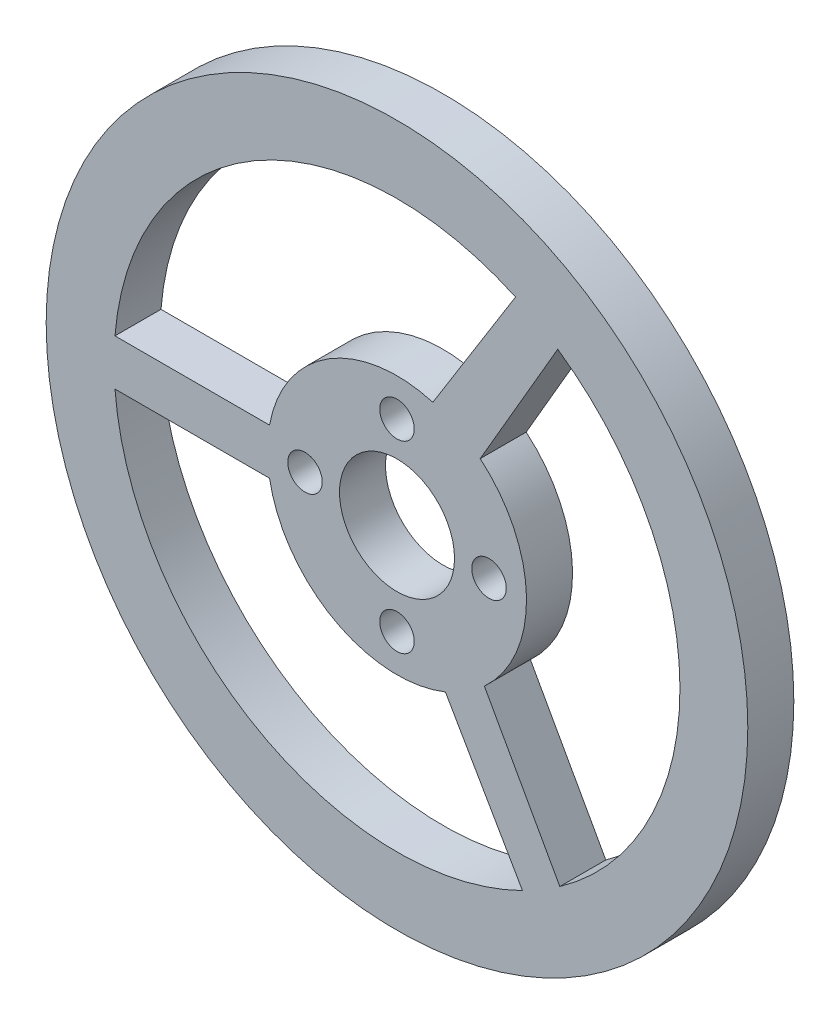
ISO-10303-21;
HEADER;
FILE_DESCRIPTION(('STEP AP214'),'2;1');
FILE_NAME('part.step','',(''),(''),'','','');
FILE_SCHEMA(('AUTOMOTIVE_DESIGN { 1 0 10303 214 1 1 1 1 }'));
ENDSEC;
DATA;
#1=APPLICATION_CONTEXT('core data for automotive mechanical design processes');
#2=APPLICATION_PROTOCOL_DEFINITION('international standard','automotive_design',2000,#1);
#3=PRODUCT_CONTEXT('',#1,'mechanical');
#4=PRODUCT('Part','Part','',(#3));
#5=PRODUCT_RELATED_PRODUCT_CATEGORY('part','',(#4));
#6=PRODUCT_DEFINITION_FORMATION('','',#4);
#7=PRODUCT_DEFINITION_CONTEXT('part definition',#1,'design');
#8=PRODUCT_DEFINITION('design','',#6,#7);
#9=PRODUCT_DEFINITION_SHAPE('','',#8);
#10=(LENGTH_UNIT() NAMED_UNIT(*) SI_UNIT(.MILLI.,.METRE.));
#11=(NAMED_UNIT(*) PLANE_ANGLE_UNIT() SI_UNIT($,.RADIAN.));
#12=(NAMED_UNIT(*) SI_UNIT($,.STERADIAN.) SOLID_ANGLE_UNIT());
#13=UNCERTAINTY_MEASURE_WITH_UNIT(LENGTH_MEASURE(1.E-05),#10,'distance_accuracy_value','');
#14=(GEOMETRIC_REPRESENTATION_CONTEXT(3) GLOBAL_UNCERTAINTY_ASSIGNED_CONTEXT((#13)) GLOBAL_UNIT_ASSIGNED_CONTEXT((#10,
#11,#12)) REPRESENTATION_CONTEXT('',''));
#15=CARTESIAN_POINT('',(0.,0.,0.));
#16=DIRECTION('',(0.,0.,1.));
#17=DIRECTION('',(1.,0.,0.));
#18=AXIS2_PLACEMENT_3D('',#15,#16,#17);
#19=CARTESIAN_POINT('',(0.,0.,4.));
#20=DIRECTION('',(0.,0.,-1.));
#21=DIRECTION('',(-1.,0.,0.));
#22=AXIS2_PLACEMENT_3D('',#19,#20,#21);
#23=CYLINDRICAL_SURFACE('',#22,30.5);
#24=CARTESIAN_POINT('',(0.,0.,4.));
#25=DIRECTION('',(0.,0.,1.));
#26=DIRECTION('',(1.,0.,0.));
#27=AXIS2_PLACEMENT_3D('',#24,#25,#26);
#28=CIRCLE('',#27,30.5);
#29=CARTESIAN_POINT('',(30.5,0.,4.));
#30=VERTEX_POINT('',#29);
#31=EDGE_CURVE('E11',#30,#30,#28,.T.);
#32=ORIENTED_EDGE('',*,*,#31,.F.);
#33=EDGE_LOOP('',(#32));
#34=FACE_BOUND('',#33,.T.);
#35=CARTESIAN_POINT('',(0.,0.,0.));
#36=DIRECTION('',(0.,0.,1.));
#37=DIRECTION('',(1.,0.,0.));
#38=AXIS2_PLACEMENT_3D('',#35,#36,#37);
#39=CIRCLE('',#38,30.5);
#40=CARTESIAN_POINT('',(30.5,0.,0.));
#41=VERTEX_POINT('',#40);
#42=EDGE_CURVE('E38',#41,#41,#39,.T.);
#43=ORIENTED_EDGE('',*,*,#42,.T.);
#44=EDGE_LOOP('',(#43));
#45=FACE_BOUND('',#44,.T.);
#46=ADVANCED_FACE('F35',(#34,#45),#23,.T.);
#47=CARTESIAN_POINT('',(0.,0.,4.));
#48=DIRECTION('',(0.,0.,1.));
#49=DIRECTION('',(1.,0.,0.));
#50=AXIS2_PLACEMENT_3D('',#47,#48,#49);
#51=PLANE('',#50);
#52=CARTESIAN_POINT('',(8.,0.,4.));
#53=DIRECTION('',(0.,0.,1.));
#54=DIRECTION('',(1.,0.,0.));
#55=AXIS2_PLACEMENT_3D('',#52,#53,#54);
#56=CIRCLE('',#55,1.5);
#57=CARTESIAN_POINT('',(9.5,0.,4.));
#58=VERTEX_POINT('',#57);
#59=EDGE_CURVE('E170',#58,#58,#56,.T.);
#60=ORIENTED_EDGE('',*,*,#59,.F.);
#61=EDGE_LOOP('',(#60));
#62=FACE_BOUND('',#61,.T.);
#63=CARTESIAN_POINT('',(0.,8.,4.));
#64=DIRECTION('',(0.,0.,1.));
#65=DIRECTION('',(1.,0.,0.));
#66=AXIS2_PLACEMENT_3D('',#63,#64,#65);
#67=CIRCLE('',#66,1.5);
#68=CARTESIAN_POINT('',(1.50000000000003,8.,4.));
#69=VERTEX_POINT('',#68);
#70=EDGE_CURVE('E200',#69,#69,#67,.T.);
#71=ORIENTED_EDGE('',*,*,#70,.F.);
#72=EDGE_LOOP('',(#71));
#73=FACE_BOUND('',#72,.T.);
#74=CARTESIAN_POINT('',(0.,0.,4.));
#75=DIRECTION('',(0.,0.,1.));
#76=DIRECTION('',(1.,0.,0.));
#77=AXIS2_PLACEMENT_3D('',#74,#75,#76);
#78=CIRCLE('',#77,24.6006788035626);
#79=CARTESIAN_POINT('',(-24.5192454532364,-2.,4.));
#80=VERTEX_POINT('',#79);
#81=CARTESIAN_POINT('',(10.9094035827717,-22.0494514912335,4.));
#82=VERTEX_POINT('',#81);
#83=EDGE_CURVE('E49',#80,#82,#78,.T.);
#84=ORIENTED_EDGE('',*,*,#83,.F.);
#85=DIRECTION('',(-1.,0.,0.));
#86=VECTOR('',#85,1.);
#87=CARTESIAN_POINT('',(-24.5192454532364,-2.,4.));
#88=LINE('',#87,#86);
#89=CARTESIAN_POINT('',(-11.0822720554823,-2.,4.));
#90=VERTEX_POINT('',#89);
#91=EDGE_CURVE('E234',#90,#80,#88,.T.);
#92=ORIENTED_EDGE('',*,*,#91,.F.);
#93=CARTESIAN_POINT('',(0.,0.,4.));
#94=DIRECTION('',(0.,0.,-1.));
#95=DIRECTION('',(1.,0.,0.));
#96=AXIS2_PLACEMENT_3D('',#93,#94,#95);
#97=CIRCLE('',#96,11.2612945042621);
#98=CARTESIAN_POINT('',(4.20953106537629,-10.4449318868701,4.));
#99=VERTEX_POINT('',#98);
#100=EDGE_CURVE('E231',#99,#90,#97,.T.);
#101=ORIENTED_EDGE('',*,*,#100,.F.);
#102=DIRECTION('',(-0.499999999999991,0.866025403784444,0.));
#103=VECTOR('',#102,1.);
#104=CARTESIAN_POINT('',(10.9094035827717,-22.0494514912335,4.));
#105=LINE('',#104,#103);
#106=EDGE_CURVE('E228',#82,#99,#105,.T.);
#107=ORIENTED_EDGE('',*,*,#106,.F.);
#108=EDGE_LOOP('',(#84,#92,#101,#107));
#109=FACE_BOUND('',#108,.T.);
#110=CARTESIAN_POINT('',(-8.,0.,4.));
#111=DIRECTION('',(0.,0.,1.));
#112=DIRECTION('',(1.,0.,0.));
#113=AXIS2_PLACEMENT_3D('',#110,#111,#112);
#114=CIRCLE('',#113,1.5);
#115=CARTESIAN_POINT('',(-6.5,0.,4.));
#116=VERTEX_POINT('',#115);
#117=EDGE_CURVE('E212',#116,#116,#114,.T.);
#118=ORIENTED_EDGE('',*,*,#117,.F.);
#119=EDGE_LOOP('',(#118));
#120=FACE_BOUND('',#119,.T.);
#121=CARTESIAN_POINT('',(0.,0.,4.));
#122=DIRECTION('',(0.,0.,1.));
#123=DIRECTION('',(1.,0.,0.));
#124=AXIS2_PLACEMENT_3D('',#121,#122,#123);
#125=CIRCLE('',#124,24.6006788035626);
#126=CARTESIAN_POINT('',(14.1555431417363,-20.1199899592046,4.));
#127=VERTEX_POINT('',#126);
#128=CARTESIAN_POINT('',(13.9760383308593,20.2450920020237,4.));
#129=VERTEX_POINT('',#128);
#130=EDGE_CURVE('E57',#127,#129,#125,.T.);
#131=ORIENTED_EDGE('',*,*,#130,.F.);
#132=DIRECTION('',(0.485574585133398,-0.874195242650364,0.));
#133=VECTOR('',#132,1.);
#134=CARTESIAN_POINT('',(14.1555431417363,-20.1199899592046,4.));
#135=LINE('',#134,#133);
#136=CARTESIAN_POINT('',(7.59712679886728,-8.312666137507,4.));
#137=VERTEX_POINT('',#136);
#138=EDGE_CURVE('E131',#137,#127,#135,.T.);
#139=ORIENTED_EDGE('',*,*,#138,.F.);
#140=CARTESIAN_POINT('',(0.,0.,4.));
#141=DIRECTION('',(0.,0.,-1.));
#142=DIRECTION('',(1.,0.,0.));
#143=AXIS2_PLACEMENT_3D('',#140,#141,#142);
#144=CIRCLE('',#143,11.2612945042621);
#145=CARTESIAN_POINT('',(7.23222593326739,8.63201378369484,4.));
#146=VERTEX_POINT('',#145);
#147=EDGE_CURVE('E154',#146,#137,#144,.T.);
#148=ORIENTED_EDGE('',*,*,#147,.F.);
#149=DIRECTION('',(-0.502176432941059,-0.864765187897035,0.));
#150=VECTOR('',#149,1.);
#151=CARTESIAN_POINT('',(13.9760383308593,20.2450920020237,4.));
#152=LINE('',#151,#150);
#153=EDGE_CURVE('E147',#129,#146,#152,.T.);
#154=ORIENTED_EDGE('',*,*,#153,.F.);
#155=EDGE_LOOP('',(#131,#139,#148,#154));
#156=FACE_BOUND('',#155,.T.);
#157=CARTESIAN_POINT('',(0.,0.,4.));
#158=DIRECTION('',(0.,0.,1.));
#159=DIRECTION('',(1.,0.,0.));
#160=AXIS2_PLACEMENT_3D('',#157,#158,#159);
#161=CIRCLE('',#160,24.6006788035626);
#162=CARTESIAN_POINT('',(10.3049216945124,22.3383523668604,4.));
#163=VERTEX_POINT('',#162);
#164=CARTESIAN_POINT('',(-24.5192454532364,2.,4.));
#165=VERTEX_POINT('',#164);
#166=EDGE_CURVE('E178',#163,#165,#161,.T.);
#167=ORIENTED_EDGE('',*,*,#166,.F.);
#168=DIRECTION('',(0.529427617858444,0.84835511282053,0.));
#169=VECTOR('',#168,1.);
#170=CARTESIAN_POINT('',(10.3049216945124,22.3383523668604,4.));
#171=LINE('',#170,#169);
#172=CARTESIAN_POINT('',(3.11747710278598,10.821187107953,4.));
#173=VERTEX_POINT('',#172);
#174=EDGE_CURVE('E186',#173,#163,#171,.T.);
#175=ORIENTED_EDGE('',*,*,#174,.F.);
#176=CARTESIAN_POINT('',(0.,0.,4.));
#177=DIRECTION('',(0.,0.,-1.));
#178=DIRECTION('',(1.,0.,0.));
#179=AXIS2_PLACEMENT_3D('',#176,#177,#178);
#180=CIRCLE('',#179,11.2612945042621);
#181=CARTESIAN_POINT('',(-11.0822720554823,2.,4.));
#182=VERTEX_POINT('',#181);
#183=EDGE_CURVE('E183',#182,#173,#180,.T.);
#184=ORIENTED_EDGE('',*,*,#183,.F.);
#185=DIRECTION('',(1.,0.,0.));
#186=VECTOR('',#185,1.);
#187=CARTESIAN_POINT('',(-24.5192454532364,2.,4.));
#188=LINE('',#187,#186);
#189=EDGE_CURVE('E180',#165,#182,#188,.T.);
#190=ORIENTED_EDGE('',*,*,#189,.F.);
#191=EDGE_LOOP('',(#167,#175,#184,#190));
#192=FACE_BOUND('',#191,.T.);
#193=CARTESIAN_POINT('',(0.,-8.,4.));
#194=DIRECTION('',(0.,0.,1.));
#195=DIRECTION('',(1.,0.,0.));
#196=AXIS2_PLACEMENT_3D('',#193,#194,#195);
#197=CIRCLE('',#196,1.5);
#198=CARTESIAN_POINT('',(1.49999999999992,-8.,4.));
#199=VERTEX_POINT('',#198);
#200=EDGE_CURVE('E163',#199,#199,#197,.T.);
#201=ORIENTED_EDGE('',*,*,#200,.F.);
#202=EDGE_LOOP('',(#201));
#203=FACE_BOUND('',#202,.T.);
#204=CARTESIAN_POINT('',(0.,0.,4.));
#205=DIRECTION('',(0.,0.,1.));
#206=DIRECTION('',(1.,0.,0.));
#207=AXIS2_PLACEMENT_3D('',#204,#205,#206);
#208=CIRCLE('',#207,5.);
#209=CARTESIAN_POINT('',(5.,0.,4.));
#210=VERTEX_POINT('',#209);
#211=EDGE_CURVE('E219',#210,#210,#208,.T.);
#212=ORIENTED_EDGE('',*,*,#211,.F.);
#213=EDGE_LOOP('',(#212));
#214=FACE_BOUND('',#213,.T.);
#215=ORIENTED_EDGE('',*,*,#31,.T.);
#216=EDGE_LOOP('',(#215));
#217=FACE_BOUND('',#216,.T.);
#218=ADVANCED_FACE('F259',(#62,#73,#109,#120,#156,#192,#203,#214,#217),#51,.T.);
#219=CARTESIAN_POINT('',(0.,0.,0.));
#220=DIRECTION('',(0.,0.,1.));
#221=DIRECTION('',(1.,0.,0.));
#222=AXIS2_PLACEMENT_3D('',#219,#220,#221);
#223=PLANE('',#222);
#224=CARTESIAN_POINT('',(8.,0.,0.));
#225=DIRECTION('',(0.,0.,1.));
#226=DIRECTION('',(1.,0.,0.));
#227=AXIS2_PLACEMENT_3D('',#224,#225,#226);
#228=CIRCLE('',#227,1.5);
#229=CARTESIAN_POINT('',(9.5,0.,0.));
#230=VERTEX_POINT('',#229);
#231=EDGE_CURVE('E204',#230,#230,#228,.F.);
#232=ORIENTED_EDGE('',*,*,#231,.F.);
#233=EDGE_LOOP('',(#232));
#234=FACE_BOUND('',#233,.T.);
#235=CARTESIAN_POINT('',(0.,8.,0.));
#236=DIRECTION('',(0.,0.,1.));
#237=DIRECTION('',(1.,0.,0.));
#238=AXIS2_PLACEMENT_3D('',#235,#236,#237);
#239=CIRCLE('',#238,1.5);
#240=CARTESIAN_POINT('',(1.50000000000003,8.,0.));
#241=VERTEX_POINT('',#240);
#242=EDGE_CURVE('E203',#241,#241,#239,.F.);
#243=ORIENTED_EDGE('',*,*,#242,.F.);
#244=EDGE_LOOP('',(#243));
#245=FACE_BOUND('',#244,.T.);
#246=DIRECTION('',(1.,0.,0.));
#247=VECTOR('',#246,1.);
#248=CARTESIAN_POINT('',(-24.5192454532364,-2.,0.));
#249=LINE('',#248,#247);
#250=CARTESIAN_POINT('',(-24.5192454532364,-2.,0.));
#251=VERTEX_POINT('',#250);
#252=CARTESIAN_POINT('',(-11.0822720554823,-2.,0.));
#253=VERTEX_POINT('',#252);
#254=EDGE_CURVE('E221',#251,#253,#249,.T.);
#255=ORIENTED_EDGE('',*,*,#254,.F.);
#256=CARTESIAN_POINT('',(0.,0.,0.));
#257=DIRECTION('',(0.,0.,1.));
#258=DIRECTION('',(1.,0.,0.));
#259=AXIS2_PLACEMENT_3D('',#256,#257,#258);
#260=CIRCLE('',#259,24.6006788035626);
#261=CARTESIAN_POINT('',(10.9094035827717,-22.0494514912335,0.));
#262=VERTEX_POINT('',#261);
#263=EDGE_CURVE('E224',#262,#251,#260,.F.);
#264=ORIENTED_EDGE('',*,*,#263,.F.);
#265=DIRECTION('',(0.49999999999999,-0.866025403784444,0.));
#266=VECTOR('',#265,1.);
#267=CARTESIAN_POINT('',(10.9094035827717,-22.0494514912335,0.));
#268=LINE('',#267,#266);
#269=CARTESIAN_POINT('',(4.2095310653763,-10.4449318868701,0.));
#270=VERTEX_POINT('',#269);
#271=EDGE_CURVE('E216',#270,#262,#268,.T.);
#272=ORIENTED_EDGE('',*,*,#271,.F.);
#273=CARTESIAN_POINT('',(0.,0.,0.));
#274=DIRECTION('',(0.,0.,1.));
#275=DIRECTION('',(1.,0.,0.));
#276=AXIS2_PLACEMENT_3D('',#273,#274,#275);
#277=CIRCLE('',#276,11.2612945042621);
#278=EDGE_CURVE('E207',#253,#270,#277,.T.);
#279=ORIENTED_EDGE('',*,*,#278,.F.);
#280=EDGE_LOOP('',(#255,#264,#272,#279));
#281=FACE_BOUND('',#280,.T.);
#282=CARTESIAN_POINT('',(-8.,0.,0.));
#283=DIRECTION('',(0.,0.,1.));
#284=DIRECTION('',(1.,0.,0.));
#285=AXIS2_PLACEMENT_3D('',#282,#283,#284);
#286=CIRCLE('',#285,1.5);
#287=CARTESIAN_POINT('',(-6.5,0.,0.));
#288=VERTEX_POINT('',#287);
#289=EDGE_CURVE('E215',#288,#288,#286,.F.);
#290=ORIENTED_EDGE('',*,*,#289,.F.);
#291=EDGE_LOOP('',(#290));
#292=FACE_BOUND('',#291,.T.);
#293=DIRECTION('',(-0.485574585133398,0.874195242650364,0.));
#294=VECTOR('',#293,1.);
#295=CARTESIAN_POINT('',(14.1555431417363,-20.1199899592046,0.));
#296=LINE('',#295,#294);
#297=CARTESIAN_POINT('',(14.1555431417363,-20.1199899592046,0.));
#298=VERTEX_POINT('',#297);
#299=CARTESIAN_POINT('',(7.59712679886728,-8.312666137507,0.));
#300=VERTEX_POINT('',#299);
#301=EDGE_CURVE('E145',#298,#300,#296,.T.);
#302=ORIENTED_EDGE('',*,*,#301,.F.);
#303=CARTESIAN_POINT('',(0.,0.,0.));
#304=DIRECTION('',(0.,0.,1.));
#305=DIRECTION('',(1.,0.,0.));
#306=AXIS2_PLACEMENT_3D('',#303,#304,#305);
#307=CIRCLE('',#306,24.6006788035626);
#308=CARTESIAN_POINT('',(13.9760383308593,20.2450920020237,0.));
#309=VERTEX_POINT('',#308);
#310=EDGE_CURVE('E125',#309,#298,#307,.F.);
#311=ORIENTED_EDGE('',*,*,#310,.F.);
#312=DIRECTION('',(0.502176432941059,0.864765187897035,0.));
#313=VECTOR('',#312,1.);
#314=CARTESIAN_POINT('',(13.9760383308593,20.2450920020237,0.));
#315=LINE('',#314,#313);
#316=CARTESIAN_POINT('',(7.23222593326739,8.63201378369484,0.));
#317=VERTEX_POINT('',#316);
#318=EDGE_CURVE('E135',#317,#309,#315,.T.);
#319=ORIENTED_EDGE('',*,*,#318,.F.);
#320=CARTESIAN_POINT('',(0.,0.,0.));
#321=DIRECTION('',(0.,0.,1.));
#322=DIRECTION('',(1.,0.,0.));
#323=AXIS2_PLACEMENT_3D('',#320,#321,#322);
#324=CIRCLE('',#323,11.2612945042621);
#325=EDGE_CURVE('E149',#300,#317,#324,.T.);
#326=ORIENTED_EDGE('',*,*,#325,.F.);
#327=EDGE_LOOP('',(#302,#311,#319,#326));
#328=FACE_BOUND('',#327,.T.);
#329=DIRECTION('',(-0.529427617858444,-0.84835511282053,0.));
#330=VECTOR('',#329,1.);
#331=CARTESIAN_POINT('',(10.3049216945124,22.3383523668604,0.));
#332=LINE('',#331,#330);
#333=CARTESIAN_POINT('',(10.3049216945124,22.3383523668604,0.));
#334=VERTEX_POINT('',#333);
#335=CARTESIAN_POINT('',(3.11747710278598,10.821187107953,0.));
#336=VERTEX_POINT('',#335);
#337=EDGE_CURVE('E172',#334,#336,#332,.T.);
#338=ORIENTED_EDGE('',*,*,#337,.F.);
#339=CARTESIAN_POINT('',(0.,0.,0.));
#340=DIRECTION('',(0.,0.,1.));
#341=DIRECTION('',(1.,0.,0.));
#342=AXIS2_PLACEMENT_3D('',#339,#340,#341);
#343=CIRCLE('',#342,24.6006788035626);
#344=CARTESIAN_POINT('',(-24.5192454532364,2.,0.));
#345=VERTEX_POINT('',#344);
#346=EDGE_CURVE('E175',#345,#334,#343,.F.);
#347=ORIENTED_EDGE('',*,*,#346,.F.);
#348=DIRECTION('',(-1.,0.,0.));
#349=VECTOR('',#348,1.);
#350=CARTESIAN_POINT('',(-24.5192454532364,2.,0.));
#351=LINE('',#350,#349);
#352=CARTESIAN_POINT('',(-11.0822720554823,2.,0.));
#353=VERTEX_POINT('',#352);
#354=EDGE_CURVE('E167',#353,#345,#351,.T.);
#355=ORIENTED_EDGE('',*,*,#354,.F.);
#356=CARTESIAN_POINT('',(0.,0.,0.));
#357=DIRECTION('',(0.,0.,1.));
#358=DIRECTION('',(1.,0.,0.));
#359=AXIS2_PLACEMENT_3D('',#356,#357,#358);
#360=CIRCLE('',#359,11.2612945042621);
#361=EDGE_CURVE('E139',#336,#353,#360,.T.);
#362=ORIENTED_EDGE('',*,*,#361,.F.);
#363=EDGE_LOOP('',(#338,#347,#355,#362));
#364=FACE_BOUND('',#363,.T.);
#365=CARTESIAN_POINT('',(0.,-8.,0.));
#366=DIRECTION('',(0.,0.,1.));
#367=DIRECTION('',(1.,0.,0.));
#368=AXIS2_PLACEMENT_3D('',#365,#366,#367);
#369=CIRCLE('',#368,1.5);
#370=CARTESIAN_POINT('',(1.49999999999992,-8.,0.));
#371=VERTEX_POINT('',#370);
#372=EDGE_CURVE('E166',#371,#371,#369,.F.);
#373=ORIENTED_EDGE('',*,*,#372,.F.);
#374=EDGE_LOOP('',(#373));
#375=FACE_BOUND('',#374,.T.);
#376=CARTESIAN_POINT('',(0.,0.,0.));
#377=DIRECTION('',(0.,0.,1.));
#378=DIRECTION('',(1.,0.,0.));
#379=AXIS2_PLACEMENT_3D('',#376,#377,#378);
#380=CIRCLE('',#379,5.);
#381=CARTESIAN_POINT('',(5.,0.,0.));
#382=VERTEX_POINT('',#381);
#383=EDGE_CURVE('E249',#382,#382,#380,.F.);
#384=ORIENTED_EDGE('',*,*,#383,.F.);
#385=EDGE_LOOP('',(#384));
#386=FACE_BOUND('',#385,.T.);
#387=ORIENTED_EDGE('',*,*,#42,.F.);
#388=EDGE_LOOP('',(#387));
#389=FACE_BOUND('',#388,.T.);
#390=ADVANCED_FACE('F142',(#234,#245,#281,#292,#328,#364,#375,#386,#389),#223,.F.);
#391=CARTESIAN_POINT('',(0.,0.,-0.00100000000000013));
#392=DIRECTION('',(0.,0.,1.));
#393=DIRECTION('',(1.,0.,0.));
#394=AXIS2_PLACEMENT_3D('',#391,#392,#393);
#395=CYLINDRICAL_SURFACE('',#394,5.);
#396=ORIENTED_EDGE('',*,*,#211,.T.);
#397=EDGE_LOOP('',(#396));
#398=FACE_BOUND('',#397,.T.);
#399=ORIENTED_EDGE('',*,*,#383,.T.);
#400=EDGE_LOOP('',(#399));
#401=FACE_BOUND('',#400,.T.);
#402=ADVANCED_FACE('F258',(#398,#401),#395,.F.);
#403=CARTESIAN_POINT('',(0.,-8.,-0.00100000000000013));
#404=DIRECTION('',(0.,0.,1.));
#405=DIRECTION('',(1.,0.,0.));
#406=AXIS2_PLACEMENT_3D('',#403,#404,#405);
#407=CYLINDRICAL_SURFACE('',#406,1.5);
#408=ORIENTED_EDGE('',*,*,#200,.T.);
#409=EDGE_LOOP('',(#408));
#410=FACE_BOUND('',#409,.T.);
#411=ORIENTED_EDGE('',*,*,#372,.T.);
#412=EDGE_LOOP('',(#411));
#413=FACE_BOUND('',#412,.T.);
#414=ADVANCED_FACE('F265',(#410,#413),#407,.F.);
#415=CARTESIAN_POINT('',(0.,0.,-0.00100000000000013));
#416=DIRECTION('',(0.,0.,1.));
#417=DIRECTION('',(1.,0.,0.));
#418=AXIS2_PLACEMENT_3D('',#415,#416,#417);
#419=CYLINDRICAL_SURFACE('',#418,24.6006788035626);
#420=ORIENTED_EDGE('',*,*,#346,.T.);
#421=DIRECTION('',(0.,0.,1.));
#422=VECTOR('',#421,1.);
#423=CARTESIAN_POINT('',(10.3049216945124,22.3383523668604,-0.00100000000000013));
#424=LINE('',#423,#422);
#425=EDGE_CURVE('E190',#334,#163,#424,.T.);
#426=ORIENTED_EDGE('',*,*,#425,.T.);
#427=ORIENTED_EDGE('',*,*,#166,.T.);
#428=DIRECTION('',(0.,0.,1.));
#429=VECTOR('',#428,1.);
#430=CARTESIAN_POINT('',(-24.5192454532364,2.,-0.00100000000000013));
#431=LINE('',#430,#429);
#432=EDGE_CURVE('E189',#345,#165,#431,.T.);
#433=ORIENTED_EDGE('',*,*,#432,.F.);
#434=EDGE_LOOP('',(#420,#426,#427,#433));
#435=FACE_BOUND('',#434,.T.);
#436=ADVANCED_FACE('F301',(#435),#419,.F.);
#437=CARTESIAN_POINT('',(10.3049216945124,22.3383523668604,-0.00100000000000013));
#438=DIRECTION('',(0.848355112820529,-0.529427617858444,0.));
#439=DIRECTION('',(0.529427617858444,0.84835511282053,0.));
#440=AXIS2_PLACEMENT_3D('',#437,#438,#439);
#441=PLANE('',#440);
#442=ORIENTED_EDGE('',*,*,#337,.T.);
#443=DIRECTION('',(0.,0.,1.));
#444=VECTOR('',#443,1.);
#445=CARTESIAN_POINT('',(3.11747710278598,10.821187107953,-0.00100000000000013));
#446=LINE('',#445,#444);
#447=EDGE_CURVE('E192',#336,#173,#446,.T.);
#448=ORIENTED_EDGE('',*,*,#447,.T.);
#449=ORIENTED_EDGE('',*,*,#174,.T.);
#450=ORIENTED_EDGE('',*,*,#425,.F.);
#451=EDGE_LOOP('',(#442,#448,#449,#450));
#452=FACE_BOUND('',#451,.T.);
#453=ADVANCED_FACE('F311',(#452),#441,.F.);
#454=CARTESIAN_POINT('',(0.,0.,-0.00100000000000013));
#455=DIRECTION('',(0.,0.,1.));
#456=DIRECTION('',(1.,0.,0.));
#457=AXIS2_PLACEMENT_3D('',#454,#455,#456);
#458=CYLINDRICAL_SURFACE('',#457,11.2612945042621);
#459=ORIENTED_EDGE('',*,*,#361,.T.);
#460=DIRECTION('',(0.,0.,1.));
#461=VECTOR('',#460,1.);
#462=CARTESIAN_POINT('',(-11.0822720554823,2.,-0.00100000000000013));
#463=LINE('',#462,#461);
#464=EDGE_CURVE('E194',#353,#182,#463,.T.);
#465=ORIENTED_EDGE('',*,*,#464,.T.);
#466=ORIENTED_EDGE('',*,*,#183,.T.);
#467=ORIENTED_EDGE('',*,*,#447,.F.);
#468=EDGE_LOOP('',(#459,#465,#466,#467));
#469=FACE_BOUND('',#468,.T.);
#470=ADVANCED_FACE('F321',(#469),#458,.T.);
#471=CARTESIAN_POINT('',(-24.5192454532364,2.,-0.00100000000000013));
#472=DIRECTION('',(0.,-1.,0.));
#473=DIRECTION('',(0.,0.,-1.));
#474=AXIS2_PLACEMENT_3D('',#471,#472,#473);
#475=PLANE('',#474);
#476=ORIENTED_EDGE('',*,*,#354,.T.);
#477=ORIENTED_EDGE('',*,*,#432,.T.);
#478=ORIENTED_EDGE('',*,*,#189,.T.);
#479=ORIENTED_EDGE('',*,*,#464,.F.);
#480=EDGE_LOOP('',(#476,#477,#478,#479));
#481=FACE_BOUND('',#480,.T.);
#482=ADVANCED_FACE('F331',(#481),#475,.F.);
#483=CARTESIAN_POINT('',(0.,0.,-0.00100000000000013));
#484=DIRECTION('',(0.,0.,1.));
#485=DIRECTION('',(1.,0.,0.));
#486=AXIS2_PLACEMENT_3D('',#483,#484,#485);
#487=CYLINDRICAL_SURFACE('',#486,24.6006788035626);
#488=ORIENTED_EDGE('',*,*,#310,.T.);
#489=DIRECTION('',(0.,0.,1.));
#490=VECTOR('',#489,1.);
#491=CARTESIAN_POINT('',(14.1555431417363,-20.1199899592046,-0.00100000000000013));
#492=LINE('',#491,#490);
#493=EDGE_CURVE('E140',#298,#127,#492,.T.);
#494=ORIENTED_EDGE('',*,*,#493,.T.);
#495=ORIENTED_EDGE('',*,*,#130,.T.);
#496=DIRECTION('',(0.,0.,1.));
#497=VECTOR('',#496,1.);
#498=CARTESIAN_POINT('',(13.9760383308593,20.2450920020237,-0.00100000000000013));
#499=LINE('',#498,#497);
#500=EDGE_CURVE('E121',#309,#129,#499,.T.);
#501=ORIENTED_EDGE('',*,*,#500,.F.);
#502=EDGE_LOOP('',(#488,#494,#495,#501));
#503=FACE_BOUND('',#502,.T.);
#504=ADVANCED_FACE('F123',(#503),#487,.F.);
#505=CARTESIAN_POINT('',(14.1555431417363,-20.1199899592046,-0.00100000000000013));
#506=DIRECTION('',(-0.874195242650364,-0.485574585133398,0.));
#507=DIRECTION('',(0.485574585133398,-0.874195242650364,0.));
#508=AXIS2_PLACEMENT_3D('',#505,#506,#507);
#509=PLANE('',#508);
#510=ORIENTED_EDGE('',*,*,#301,.T.);
#511=DIRECTION('',(0.,0.,1.));
#512=VECTOR('',#511,1.);
#513=CARTESIAN_POINT('',(7.59712679886728,-8.312666137507,-0.00100000000000013));
#514=LINE('',#513,#512);
#515=EDGE_CURVE('E160',#300,#137,#514,.T.);
#516=ORIENTED_EDGE('',*,*,#515,.T.);
#517=ORIENTED_EDGE('',*,*,#138,.T.);
#518=ORIENTED_EDGE('',*,*,#493,.F.);
#519=EDGE_LOOP('',(#510,#516,#517,#518));
#520=FACE_BOUND('',#519,.T.);
#521=ADVANCED_FACE('F350',(#520),#509,.F.);
#522=CARTESIAN_POINT('',(0.,0.,-0.00100000000000013));
#523=DIRECTION('',(0.,0.,1.));
#524=DIRECTION('',(1.,0.,0.));
#525=AXIS2_PLACEMENT_3D('',#522,#523,#524);
#526=CYLINDRICAL_SURFACE('',#525,11.2612945042621);
#527=ORIENTED_EDGE('',*,*,#325,.T.);
#528=DIRECTION('',(0.,0.,1.));
#529=VECTOR('',#528,1.);
#530=CARTESIAN_POINT('',(7.23222593326739,8.63201378369484,-0.00100000000000013));
#531=LINE('',#530,#529);
#532=EDGE_CURVE('E130',#317,#146,#531,.T.);
#533=ORIENTED_EDGE('',*,*,#532,.T.);
#534=ORIENTED_EDGE('',*,*,#147,.T.);
#535=ORIENTED_EDGE('',*,*,#515,.F.);
#536=EDGE_LOOP('',(#527,#533,#534,#535));
#537=FACE_BOUND('',#536,.T.);
#538=ADVANCED_FACE('F359',(#537),#526,.T.);
#539=CARTESIAN_POINT('',(13.9760383308593,20.2450920020237,-0.00100000000000013));
#540=DIRECTION('',(-0.864765187897035,0.502176432941059,0.));
#541=DIRECTION('',(-0.502176432941059,-0.864765187897035,0.));
#542=AXIS2_PLACEMENT_3D('',#539,#540,#541);
#543=PLANE('',#542);
#544=ORIENTED_EDGE('',*,*,#318,.T.);
#545=ORIENTED_EDGE('',*,*,#500,.T.);
#546=ORIENTED_EDGE('',*,*,#153,.T.);
#547=ORIENTED_EDGE('',*,*,#532,.F.);
#548=EDGE_LOOP('',(#544,#545,#546,#547));
#549=FACE_BOUND('',#548,.T.);
#550=ADVANCED_FACE('F136',(#549),#543,.F.);
#551=CARTESIAN_POINT('',(-8.,0.,-0.00100000000000013));
#552=DIRECTION('',(0.,0.,1.));
#553=DIRECTION('',(1.,0.,0.));
#554=AXIS2_PLACEMENT_3D('',#551,#552,#553);
#555=CYLINDRICAL_SURFACE('',#554,1.5);
#556=ORIENTED_EDGE('',*,*,#117,.T.);
#557=EDGE_LOOP('',(#556));
#558=FACE_BOUND('',#557,.T.);
#559=ORIENTED_EDGE('',*,*,#289,.T.);
#560=EDGE_LOOP('',(#559));
#561=FACE_BOUND('',#560,.T.);
#562=ADVANCED_FACE('F378',(#558,#561),#555,.F.);
#563=CARTESIAN_POINT('',(0.,0.,-0.00100000000000013));
#564=DIRECTION('',(0.,0.,1.));
#565=DIRECTION('',(1.,0.,0.));
#566=AXIS2_PLACEMENT_3D('',#563,#564,#565);
#567=CYLINDRICAL_SURFACE('',#566,24.6006788035626);
#568=ORIENTED_EDGE('',*,*,#263,.T.);
#569=DIRECTION('',(0.,0.,1.));
#570=VECTOR('',#569,1.);
#571=CARTESIAN_POINT('',(-24.5192454532364,-2.,-0.00100000000000013));
#572=LINE('',#571,#570);
#573=EDGE_CURVE('E238',#251,#80,#572,.T.);
#574=ORIENTED_EDGE('',*,*,#573,.T.);
#575=ORIENTED_EDGE('',*,*,#83,.T.);
#576=DIRECTION('',(0.,0.,1.));
#577=VECTOR('',#576,1.);
#578=CARTESIAN_POINT('',(10.9094035827717,-22.0494514912335,-0.00100000000000013));
#579=LINE('',#578,#577);
#580=EDGE_CURVE('E237',#262,#82,#579,.T.);
#581=ORIENTED_EDGE('',*,*,#580,.F.);
#582=EDGE_LOOP('',(#568,#574,#575,#581));
#583=FACE_BOUND('',#582,.T.);
#584=ADVANCED_FACE('F387',(#583),#567,.F.);
#585=CARTESIAN_POINT('',(-24.5192454532364,-2.,-0.00100000000000013));
#586=DIRECTION('',(0.,1.,0.));
#587=DIRECTION('',(0.,0.,1.));
#588=AXIS2_PLACEMENT_3D('',#585,#586,#587);
#589=PLANE('',#588);
#590=ORIENTED_EDGE('',*,*,#254,.T.);
#591=DIRECTION('',(0.,0.,1.));
#592=VECTOR('',#591,1.);
#593=CARTESIAN_POINT('',(-11.0822720554823,-2.,-0.00100000000000013));
#594=LINE('',#593,#592);
#595=EDGE_CURVE('E240',#253,#90,#594,.T.);
#596=ORIENTED_EDGE('',*,*,#595,.T.);
#597=ORIENTED_EDGE('',*,*,#91,.T.);
#598=ORIENTED_EDGE('',*,*,#573,.F.);
#599=EDGE_LOOP('',(#590,#596,#597,#598));
#600=FACE_BOUND('',#599,.T.);
#601=ADVANCED_FACE('F397',(#600),#589,.F.);
#602=CARTESIAN_POINT('',(0.,0.,-0.00100000000000013));
#603=DIRECTION('',(0.,0.,1.));
#604=DIRECTION('',(1.,0.,0.));
#605=AXIS2_PLACEMENT_3D('',#602,#603,#604);
#606=CYLINDRICAL_SURFACE('',#605,11.2612945042621);
#607=ORIENTED_EDGE('',*,*,#278,.T.);
#608=DIRECTION('',(0.,0.,1.));
#609=VECTOR('',#608,1.);
#610=CARTESIAN_POINT('',(4.20953106537629,-10.4449318868701,-0.00100000000000013));
#611=LINE('',#610,#609);
#612=EDGE_CURVE('E242',#270,#99,#611,.T.);
#613=ORIENTED_EDGE('',*,*,#612,.T.);
#614=ORIENTED_EDGE('',*,*,#100,.T.);
#615=ORIENTED_EDGE('',*,*,#595,.F.);
#616=EDGE_LOOP('',(#607,#613,#614,#615));
#617=FACE_BOUND('',#616,.T.);
#618=ADVANCED_FACE('F406',(#617),#606,.T.);
#619=CARTESIAN_POINT('',(10.9094035827717,-22.0494514912335,-0.00100000000000013));
#620=DIRECTION('',(0.866025403784444,0.49999999999999,0.));
#621=DIRECTION('',(-0.49999999999999,0.866025403784444,0.));
#622=AXIS2_PLACEMENT_3D('',#619,#620,#621);
#623=PLANE('',#622);
#624=ORIENTED_EDGE('',*,*,#271,.T.);
#625=ORIENTED_EDGE('',*,*,#580,.T.);
#626=ORIENTED_EDGE('',*,*,#106,.T.);
#627=ORIENTED_EDGE('',*,*,#612,.F.);
#628=EDGE_LOOP('',(#624,#625,#626,#627));
#629=FACE_BOUND('',#628,.T.);
#630=ADVANCED_FACE('F416',(#629),#623,.F.);
#631=CARTESIAN_POINT('',(0.,8.,-0.00100000000000013));
#632=DIRECTION('',(0.,0.,1.));
#633=DIRECTION('',(1.,0.,0.));
#634=AXIS2_PLACEMENT_3D('',#631,#632,#633);
#635=CYLINDRICAL_SURFACE('',#634,1.5);
#636=ORIENTED_EDGE('',*,*,#70,.T.);
#637=EDGE_LOOP('',(#636));
#638=FACE_BOUND('',#637,.T.);
#639=ORIENTED_EDGE('',*,*,#242,.T.);
#640=EDGE_LOOP('',(#639));
#641=FACE_BOUND('',#640,.T.);
#642=ADVANCED_FACE('F426',(#638,#641),#635,.F.);
#643=CARTESIAN_POINT('',(8.,0.,-0.00100000000000013));
#644=DIRECTION('',(0.,0.,1.));
#645=DIRECTION('',(1.,0.,0.));
#646=AXIS2_PLACEMENT_3D('',#643,#644,#645);
#647=CYLINDRICAL_SURFACE('',#646,1.5);
#648=ORIENTED_EDGE('',*,*,#59,.T.);
#649=EDGE_LOOP('',(#648));
#650=FACE_BOUND('',#649,.T.);
#651=ORIENTED_EDGE('',*,*,#231,.T.);
#652=EDGE_LOOP('',(#651));
#653=FACE_BOUND('',#652,.T.);
#654=ADVANCED_FACE('F436',(#650,#653),#647,.F.);
#655=CLOSED_SHELL('',(#46,#218,#390,#402,#414,#436,#453,#470,#482,#504,#521,#538,#550,#562,#584,
#601,#618,#630,#642,#654));
#656=MANIFOLD_SOLID_BREP('B2',#655);
#657=ADVANCED_BREP_SHAPE_REPRESENTATION('',(#18,#656),#14);
#658=SHAPE_DEFINITION_REPRESENTATION(#9,#657);
ENDSEC;
END-ISO-10303-21;
